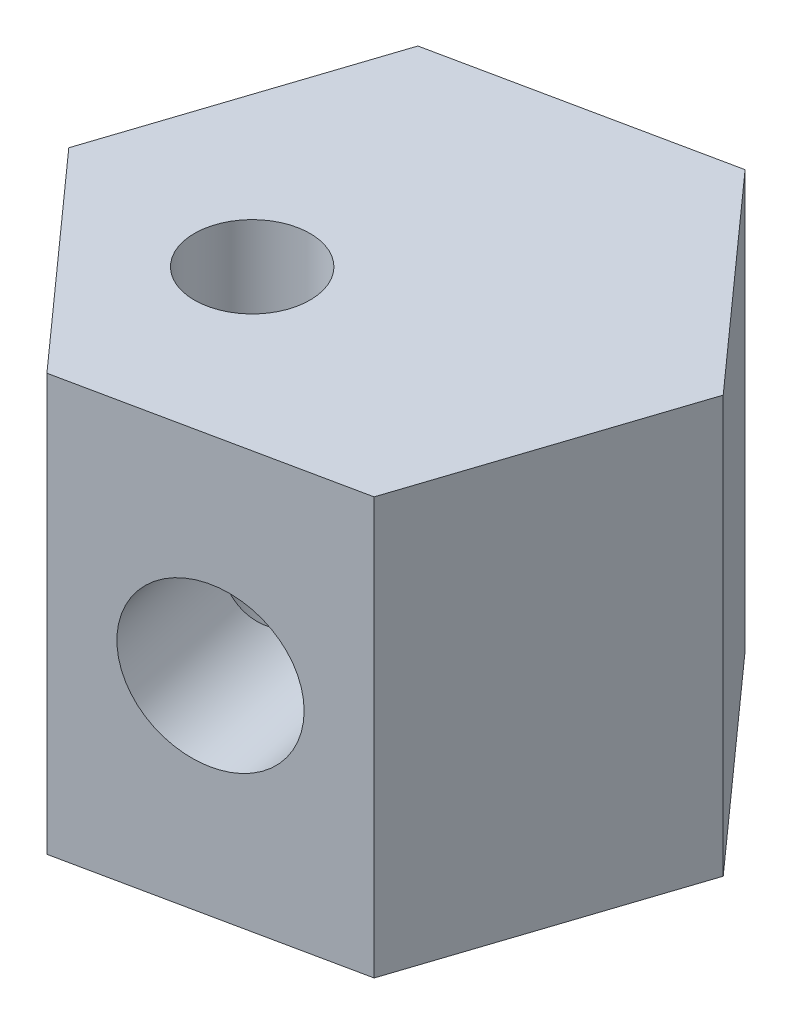
ISO-10303-21;
HEADER;
FILE_DESCRIPTION(('STEP AP214'),'2;1');
FILE_NAME('part.step','',(''),(''),'','','');
FILE_SCHEMA(('AUTOMOTIVE_DESIGN { 1 0 10303 214 1 1 1 1 }'));
ENDSEC;
DATA;
#1=APPLICATION_CONTEXT('core data for automotive mechanical design processes');
#2=APPLICATION_PROTOCOL_DEFINITION('international standard','automotive_design',2000,#1);
#3=PRODUCT_CONTEXT('',#1,'mechanical');
#4=PRODUCT('Part','Part','',(#3));
#5=PRODUCT_RELATED_PRODUCT_CATEGORY('part','',(#4));
#6=PRODUCT_DEFINITION_FORMATION('','',#4);
#7=PRODUCT_DEFINITION_CONTEXT('part definition',#1,'design');
#8=PRODUCT_DEFINITION('design','',#6,#7);
#9=PRODUCT_DEFINITION_SHAPE('','',#8);
#10=(LENGTH_UNIT() NAMED_UNIT(*) SI_UNIT(.MILLI.,.METRE.));
#11=(NAMED_UNIT(*) PLANE_ANGLE_UNIT() SI_UNIT($,.RADIAN.));
#12=(NAMED_UNIT(*) SI_UNIT($,.STERADIAN.) SOLID_ANGLE_UNIT());
#13=UNCERTAINTY_MEASURE_WITH_UNIT(LENGTH_MEASURE(1.E-05),#10,'distance_accuracy_value','');
#14=(GEOMETRIC_REPRESENTATION_CONTEXT(3) GLOBAL_UNCERTAINTY_ASSIGNED_CONTEXT((#13)) GLOBAL_UNIT_ASSIGNED_CONTEXT((#10,
#11,#12)) REPRESENTATION_CONTEXT('',''));
#15=CARTESIAN_POINT('',(0.,0.,0.));
#16=DIRECTION('',(0.,0.,1.));
#17=DIRECTION('',(1.,0.,0.));
#18=AXIS2_PLACEMENT_3D('',#15,#16,#17);
#19=CARTESIAN_POINT('',(18.73,28.83,-3.9100063291939));
#20=DIRECTION('',(-0.74557469293488,0.,0.666422071404496));
#21=DIRECTION('',(0.666422071404496,0.,0.74557469293488));
#22=AXIS2_PLACEMENT_3D('',#19,#20,#21);
#23=PLANE('',#22);
#24=DIRECTION('',(-0.666422071404496,0.,-0.74557469293488));
#25=VECTOR('',#24,1.);
#26=CARTESIAN_POINT('',(18.73,0.,-3.9100063291939));
#27=LINE('',#26,#25);
#28=CARTESIAN_POINT('',(18.73,0.,-3.9100063291939));
#29=VERTEX_POINT('',#28);
#30=CARTESIAN_POINT('',(5.97883518996014,0.,-18.1756589774795));
#31=VERTEX_POINT('',#30);
#32=EDGE_CURVE('E125',#29,#31,#27,.T.);
#33=ORIENTED_EDGE('',*,*,#32,.T.);
#34=DIRECTION('',(0.,-1.,0.));
#35=VECTOR('',#34,1.);
#36=CARTESIAN_POINT('',(5.97883518996014,28.83,-18.1756589774795));
#37=LINE('',#36,#35);
#38=CARTESIAN_POINT('',(5.97883518996014,28.83,-18.1756589774795));
#39=VERTEX_POINT('',#38);
#40=EDGE_CURVE('E11',#39,#31,#37,.T.);
#41=ORIENTED_EDGE('',*,*,#40,.F.);
#42=DIRECTION('',(-0.666422071404496,0.,-0.74557469293488));
#43=VECTOR('',#42,1.);
#44=CARTESIAN_POINT('',(18.73,28.83,-3.9100063291939));
#45=LINE('',#44,#43);
#46=CARTESIAN_POINT('',(18.73,28.83,-3.9100063291939));
#47=VERTEX_POINT('',#46);
#48=EDGE_CURVE('E136',#47,#39,#45,.T.);
#49=ORIENTED_EDGE('',*,*,#48,.F.);
#50=DIRECTION('',(0.,-1.,0.));
#51=VECTOR('',#50,1.);
#52=CARTESIAN_POINT('',(18.73,28.83,-3.9100063291939));
#53=LINE('',#52,#51);
#54=EDGE_CURVE('E121',#47,#29,#53,.T.);
#55=ORIENTED_EDGE('',*,*,#54,.T.);
#56=EDGE_LOOP('',(#33,#41,#49,#55));
#57=FACE_BOUND('',#56,.T.);
#58=ADVANCED_FACE('F35',(#57),#23,.F.);
#59=CARTESIAN_POINT('',(5.97883518996014,28.83,-18.1756589774795));
#60=DIRECTION('',(0.204351097011501,0.,0.978897660202636));
#61=DIRECTION('',(0.978897660202636,0.,-0.204351097011501));
#62=AXIS2_PLACEMENT_3D('',#59,#60,#61);
#63=PLANE('',#62);
#64=CARTESIAN_POINT('',(-3.38616481003986,14.415,-16.2206558128825));
#65=DIRECTION('',(0.204351097011501,0.,0.978897660202636));
#66=DIRECTION('',(0.978897660202636,0.,-0.204351097011501));
#67=AXIS2_PLACEMENT_3D('',#64,#65,#66);
#68=CIRCLE('',#67,5.475);
#69=CARTESIAN_POINT('',(1.97329987956957,14.415,-17.3394780690205));
#70=VERTEX_POINT('',#69);
#71=EDGE_CURVE('E129',#70,#70,#68,.T.);
#72=ORIENTED_EDGE('',*,*,#71,.T.);
#73=EDGE_LOOP('',(#72));
#74=FACE_BOUND('',#73,.T.);
#75=DIRECTION('',(-0.978897660202636,0.,0.204351097011501));
#76=VECTOR('',#75,1.);
#77=CARTESIAN_POINT('',(5.97883518996014,0.,-18.1756589774795));
#78=LINE('',#77,#76);
#79=CARTESIAN_POINT('',(-12.7511648100399,0.,-14.2656526482856));
#80=VERTEX_POINT('',#79);
#81=EDGE_CURVE('E128',#31,#80,#78,.T.);
#82=ORIENTED_EDGE('',*,*,#81,.T.);
#83=DIRECTION('',(0.,-1.,0.));
#84=VECTOR('',#83,1.);
#85=CARTESIAN_POINT('',(-12.7511648100399,28.83,-14.2656526482856));
#86=LINE('',#85,#84);
#87=CARTESIAN_POINT('',(-12.7511648100399,28.83,-14.2656526482856));
#88=VERTEX_POINT('',#87);
#89=EDGE_CURVE('E49',#88,#80,#86,.T.);
#90=ORIENTED_EDGE('',*,*,#89,.F.);
#91=DIRECTION('',(-0.978897660202636,0.,0.204351097011501));
#92=VECTOR('',#91,1.);
#93=CARTESIAN_POINT('',(5.97883518996014,28.83,-18.1756589774795));
#94=LINE('',#93,#92);
#95=EDGE_CURVE('E94',#39,#88,#94,.T.);
#96=ORIENTED_EDGE('',*,*,#95,.F.);
#97=ORIENTED_EDGE('',*,*,#40,.T.);
#98=EDGE_LOOP('',(#82,#90,#96,#97));
#99=FACE_BOUND('',#98,.T.);
#100=ADVANCED_FACE('F163',(#74,#99),#63,.F.);
#101=CARTESIAN_POINT('',(-12.7511648100399,28.83,-14.2656526482856));
#102=DIRECTION('',(0.949925789946381,0.,0.31247558879814));
#103=DIRECTION('',(0.31247558879814,0.,-0.949925789946381));
#104=AXIS2_PLACEMENT_3D('',#101,#102,#103);
#105=PLANE('',#104);
#106=DIRECTION('',(-0.31247558879814,0.,0.949925789946381));
#107=VECTOR('',#106,1.);
#108=CARTESIAN_POINT('',(-12.7511648100399,0.,-14.2656526482856));
#109=LINE('',#108,#107);
#110=CARTESIAN_POINT('',(-18.73,0.,3.91000632919391));
#111=VERTEX_POINT('',#110);
#112=EDGE_CURVE('E131',#80,#111,#109,.T.);
#113=ORIENTED_EDGE('',*,*,#112,.T.);
#114=DIRECTION('',(0.,-1.,0.));
#115=VECTOR('',#114,1.);
#116=CARTESIAN_POINT('',(-18.73,28.83,3.91000632919391));
#117=LINE('',#116,#115);
#118=CARTESIAN_POINT('',(-18.73,28.83,3.91000632919391));
#119=VERTEX_POINT('',#118);
#120=EDGE_CURVE('E116',#119,#111,#117,.T.);
#121=ORIENTED_EDGE('',*,*,#120,.F.);
#122=DIRECTION('',(-0.31247558879814,0.,0.949925789946381));
#123=VECTOR('',#122,1.);
#124=CARTESIAN_POINT('',(-12.7511648100399,28.83,-14.2656526482856));
#125=LINE('',#124,#123);
#126=EDGE_CURVE('E107',#88,#119,#125,.T.);
#127=ORIENTED_EDGE('',*,*,#126,.F.);
#128=ORIENTED_EDGE('',*,*,#89,.T.);
#129=EDGE_LOOP('',(#113,#121,#127,#128));
#130=FACE_BOUND('',#129,.T.);
#131=ADVANCED_FACE('F143',(#130),#105,.F.);
#132=CARTESIAN_POINT('',(-18.73,28.83,3.91000632919391));
#133=DIRECTION('',(0.74557469293488,0.,-0.666422071404496));
#134=DIRECTION('',(-0.666422071404496,0.,-0.74557469293488));
#135=AXIS2_PLACEMENT_3D('',#132,#133,#134);
#136=PLANE('',#135);
#137=DIRECTION('',(0.666422071404496,0.,0.74557469293488));
#138=VECTOR('',#137,1.);
#139=CARTESIAN_POINT('',(-18.73,0.,3.91000632919391));
#140=LINE('',#139,#138);
#141=CARTESIAN_POINT('',(-5.97883518996014,0.,18.1756589774795));
#142=VERTEX_POINT('',#141);
#143=EDGE_CURVE('E115',#111,#142,#140,.T.);
#144=ORIENTED_EDGE('',*,*,#143,.T.);
#145=DIRECTION('',(0.,-1.,0.));
#146=VECTOR('',#145,1.);
#147=CARTESIAN_POINT('',(-5.97883518996014,28.83,18.1756589774795));
#148=LINE('',#147,#146);
#149=CARTESIAN_POINT('',(-5.97883518996014,28.83,18.1756589774795));
#150=VERTEX_POINT('',#149);
#151=EDGE_CURVE('E112',#150,#142,#148,.T.);
#152=ORIENTED_EDGE('',*,*,#151,.F.);
#153=DIRECTION('',(0.666422071404496,0.,0.74557469293488));
#154=VECTOR('',#153,1.);
#155=CARTESIAN_POINT('',(-18.73,28.83,3.91000632919391));
#156=LINE('',#155,#154);
#157=EDGE_CURVE('E101',#119,#150,#156,.T.);
#158=ORIENTED_EDGE('',*,*,#157,.F.);
#159=ORIENTED_EDGE('',*,*,#120,.T.);
#160=EDGE_LOOP('',(#144,#152,#158,#159));
#161=FACE_BOUND('',#160,.T.);
#162=ADVANCED_FACE('F113',(#161),#136,.F.);
#163=CARTESIAN_POINT('',(-5.97883518996014,28.83,18.1756589774795));
#164=DIRECTION('',(-0.204351097011501,0.,-0.978897660202636));
#165=DIRECTION('',(-0.978897660202636,0.,0.204351097011501));
#166=AXIS2_PLACEMENT_3D('',#163,#164,#165);
#167=PLANE('',#166);
#168=CARTESIAN_POINT('',(3.38616481003986,14.415,16.2206558128825));
#169=DIRECTION('',(0.204351097011501,0.,0.978897660202636));
#170=DIRECTION('',(0.978897660202636,0.,-0.204351097011501));
#171=AXIS2_PLACEMENT_3D('',#168,#169,#170);
#172=CIRCLE('',#171,5.475);
#173=CARTESIAN_POINT('',(8.7456294996493,14.415,15.1018335567446));
#174=VERTEX_POINT('',#173);
#175=EDGE_CURVE('E234',#174,#174,#172,.T.);
#176=ORIENTED_EDGE('',*,*,#175,.F.);
#177=EDGE_LOOP('',(#176));
#178=FACE_BOUND('',#177,.T.);
#179=DIRECTION('',(0.978897660202636,0.,-0.204351097011501));
#180=VECTOR('',#179,1.);
#181=CARTESIAN_POINT('',(-5.97883518996014,0.,18.1756589774795));
#182=LINE('',#181,#180);
#183=CARTESIAN_POINT('',(12.7511648100399,0.,14.2656526482856));
#184=VERTEX_POINT('',#183);
#185=EDGE_CURVE('E80',#142,#184,#182,.T.);
#186=ORIENTED_EDGE('',*,*,#185,.T.);
#187=DIRECTION('',(0.,-1.,0.));
#188=VECTOR('',#187,1.);
#189=CARTESIAN_POINT('',(12.7511648100399,28.83,14.2656526482856));
#190=LINE('',#189,#188);
#191=CARTESIAN_POINT('',(12.7511648100399,28.83,14.2656526482856));
#192=VERTEX_POINT('',#191);
#193=EDGE_CURVE('E117',#192,#184,#190,.T.);
#194=ORIENTED_EDGE('',*,*,#193,.F.);
#195=DIRECTION('',(0.978897660202636,0.,-0.204351097011501));
#196=VECTOR('',#195,1.);
#197=CARTESIAN_POINT('',(-5.97883518996014,28.83,18.1756589774795));
#198=LINE('',#197,#196);
#199=EDGE_CURVE('E105',#150,#192,#198,.T.);
#200=ORIENTED_EDGE('',*,*,#199,.F.);
#201=ORIENTED_EDGE('',*,*,#151,.T.);
#202=EDGE_LOOP('',(#186,#194,#200,#201));
#203=FACE_BOUND('',#202,.T.);
#204=ADVANCED_FACE('F119',(#178,#203),#167,.F.);
#205=CARTESIAN_POINT('',(12.7511648100399,28.83,14.2656526482856));
#206=DIRECTION('',(-0.949925789946381,0.,-0.31247558879814));
#207=DIRECTION('',(-0.31247558879814,0.,0.949925789946381));
#208=AXIS2_PLACEMENT_3D('',#205,#206,#207);
#209=PLANE('',#208);
#210=DIRECTION('',(0.31247558879814,0.,-0.949925789946381));
#211=VECTOR('',#210,1.);
#212=CARTESIAN_POINT('',(12.7511648100399,0.,14.2656526482856));
#213=LINE('',#212,#211);
#214=EDGE_CURVE('E86',#184,#29,#213,.T.);
#215=ORIENTED_EDGE('',*,*,#214,.T.);
#216=ORIENTED_EDGE('',*,*,#54,.F.);
#217=DIRECTION('',(0.31247558879814,0.,-0.949925789946381));
#218=VECTOR('',#217,1.);
#219=CARTESIAN_POINT('',(12.7511648100399,28.83,14.2656526482856));
#220=LINE('',#219,#218);
#221=EDGE_CURVE('E57',#192,#47,#220,.T.);
#222=ORIENTED_EDGE('',*,*,#221,.F.);
#223=ORIENTED_EDGE('',*,*,#193,.T.);
#224=EDGE_LOOP('',(#215,#216,#222,#223));
#225=FACE_BOUND('',#224,.T.);
#226=ADVANCED_FACE('F150',(#225),#209,.F.);
#227=CARTESIAN_POINT('',(0.,28.83,0.));
#228=DIRECTION('',(0.,1.,0.));
#229=DIRECTION('',(0.,0.,1.));
#230=AXIS2_PLACEMENT_3D('',#227,#228,#229);
#231=PLANE('',#230);
#232=CARTESIAN_POINT('',(-5.25397962491386,28.83,4.69620014993981));
#233=DIRECTION('',(0.,1.,0.));
#234=DIRECTION('',(0.,0.,1.));
#235=AXIS2_PLACEMENT_3D('',#232,#233,#234);
#236=CIRCLE('',#235,4.);
#237=CARTESIAN_POINT('',(-5.25397962491386,28.83,8.69620014993981));
#238=VERTEX_POINT('',#237);
#239=EDGE_CURVE('E227',#238,#238,#236,.T.);
#240=ORIENTED_EDGE('',*,*,#239,.F.);
#241=EDGE_LOOP('',(#240));
#242=FACE_BOUND('',#241,.T.);
#243=ORIENTED_EDGE('',*,*,#48,.T.);
#244=ORIENTED_EDGE('',*,*,#95,.T.);
#245=ORIENTED_EDGE('',*,*,#126,.T.);
#246=ORIENTED_EDGE('',*,*,#157,.T.);
#247=ORIENTED_EDGE('',*,*,#199,.T.);
#248=ORIENTED_EDGE('',*,*,#221,.T.);
#249=EDGE_LOOP('',(#243,#244,#245,#246,#247,#248));
#250=FACE_BOUND('',#249,.T.);
#251=ADVANCED_FACE('F103',(#242,#250),#231,.T.);
#252=CARTESIAN_POINT('',(0.,0.,0.));
#253=DIRECTION('',(0.,1.,0.));
#254=DIRECTION('',(0.,0.,1.));
#255=AXIS2_PLACEMENT_3D('',#252,#253,#254);
#256=PLANE('',#255);
#257=CARTESIAN_POINT('',(-5.25397962491386,0.,4.69620014993981));
#258=DIRECTION('',(0.,1.,0.));
#259=DIRECTION('',(0.,0.,1.));
#260=AXIS2_PLACEMENT_3D('',#257,#258,#259);
#261=CIRCLE('',#260,4.);
#262=CARTESIAN_POINT('',(-5.25397962491386,0.,8.69620014993981));
#263=VERTEX_POINT('',#262);
#264=EDGE_CURVE('E231',#263,#263,#261,.T.);
#265=ORIENTED_EDGE('',*,*,#264,.T.);
#266=EDGE_LOOP('',(#265));
#267=FACE_BOUND('',#266,.T.);
#268=ORIENTED_EDGE('',*,*,#32,.F.);
#269=ORIENTED_EDGE('',*,*,#214,.F.);
#270=ORIENTED_EDGE('',*,*,#185,.F.);
#271=ORIENTED_EDGE('',*,*,#143,.F.);
#272=ORIENTED_EDGE('',*,*,#112,.F.);
#273=ORIENTED_EDGE('',*,*,#81,.F.);
#274=EDGE_LOOP('',(#268,#269,#270,#271,#272,#273));
#275=FACE_BOUND('',#274,.T.);
#276=ADVANCED_FACE('F146',(#267,#275),#256,.F.);
#277=CARTESIAN_POINT('',(-13.3706251449032,14.415,-64.0489523237337));
#278=DIRECTION('',(0.204351097011501,0.,0.978897660202636));
#279=DIRECTION('',(0.978897660202636,0.,-0.204351097011501));
#280=AXIS2_PLACEMENT_3D('',#277,#278,#279);
#281=CYLINDRICAL_SURFACE('',#280,5.475);
#282=CARTESIAN_POINT('',(-5.44671979196973,14.415,0.700846444946555));
#283=CARTESIAN_POINT('',(-5.44671932996338,14.2442882142653,0.700844570930919));
#284=CARTESIAN_POINT('',(-5.43864239691892,14.0735593124056,0.700431740314194));
#285=CARTESIAN_POINT('',(-5.40634646627643,13.7336068470725,0.699071022490615));
#286=CARTESIAN_POINT('',(-5.38212407291833,13.5643836078633,0.698123022731856));
#287=CARTESIAN_POINT('',(-5.31757364133624,13.2289031656981,0.696575334617757));
#288=CARTESIAN_POINT('',(-5.2772341636406,13.0626481572602,0.69597589440418));
#289=CARTESIAN_POINT('',(-5.18059510562908,12.7348596870066,0.696581470328495));
#290=CARTESIAN_POINT('',(-5.1242988146617,12.5733252596496,0.697786114790132));
#291=CARTESIAN_POINT('',(-5.0036745559567,12.2754682275964,0.703639811205725));
#292=CARTESIAN_POINT('',(-4.94109318323438,12.1384289726995,0.707863032351391));
#293=CARTESIAN_POINT('',(-4.80416623720138,11.8705539079886,0.720977198669178));
#294=CARTESIAN_POINT('',(-4.72982038725676,11.7397182441421,0.729868253613742));
#295=CARTESIAN_POINT('',(-4.57029532314061,11.4859787353574,0.754238042394673));
#296=CARTESIAN_POINT('',(-4.48514801980157,11.3630530720235,0.769697674505164));
#297=CARTESIAN_POINT('',(-4.30499363301192,11.1261710616869,0.80931010052227));
#298=CARTESIAN_POINT('',(-4.20999171352194,11.0122100715691,0.833458357678645));
#299=CARTESIAN_POINT('',(-4.04307828181516,10.8289188527064,0.883231254905319));
#300=CARTESIAN_POINT('',(-3.97331626684821,10.7568350609931,0.905996353583617));
#301=CARTESIAN_POINT('',(-3.83071758032128,10.6179304070752,0.957208277305111));
#302=CARTESIAN_POINT('',(-3.7578817010418,10.5511082012825,0.985653645242621));
#303=CARTESIAN_POINT('',(-3.61003690799761,10.4230968025676,1.04874796089784));
#304=CARTESIAN_POINT('',(-3.53502900159616,10.361905051616,1.08339407021234));
#305=CARTESIAN_POINT('',(-3.38381240375823,10.2453716814535,1.15930462052926));
#306=CARTESIAN_POINT('',(-3.30760366921122,10.1900302728261,1.20056929963319));
#307=CARTESIAN_POINT('',(-3.15481915386376,10.0851507170114,1.29011852385531));
#308=CARTESIAN_POINT('',(-3.07824303073846,10.0356338784055,1.33842747984167));
#309=CARTESIAN_POINT('',(-2.9261506190157,9.94263189828677,1.44202175502169));
#310=CARTESIAN_POINT('',(-2.85063433672275,9.89914679264033,1.49730711569525));
#311=CARTESIAN_POINT('',(-2.70178848284588,9.81806287914998,1.61475412575604));
#312=CARTESIAN_POINT('',(-2.6284594260988,9.7804654484533,1.67691737812027));
#313=CARTESIAN_POINT('',(-2.48508643628124,9.71091458047684,1.80783497985879));
#314=CARTESIAN_POINT('',(-2.41504240923113,9.67896098166332,1.8765891405059));
#315=CARTESIAN_POINT('',(-2.28317733634347,9.62206466760694,2.01608754929861));
#316=CARTESIAN_POINT('',(-2.22111496241671,9.596821811162,2.08648204651825));
#317=CARTESIAN_POINT('',(-2.10145807676479,9.55070142010797,2.2323595983266));
#318=CARTESIAN_POINT('',(-2.04386512794508,9.52982540824499,2.3078444158488));
#319=CARTESIAN_POINT('',(-1.93380027607785,9.49211948966779,2.4633804608781));
#320=CARTESIAN_POINT('',(-1.88132691137695,9.47528842609138,2.54343037463655));
#321=CARTESIAN_POINT('',(-1.78197545685594,9.4453386176669,2.70763292191346));
#322=CARTESIAN_POINT('',(-1.73509949411334,9.4322212814986,2.79178709809747));
#323=CARTESIAN_POINT('',(-1.64612150139419,9.40909510498959,2.96611054316569));
#324=CARTESIAN_POINT('',(-1.60419600617925,9.3991867545163,3.05638327156967));
#325=CARTESIAN_POINT('',(-1.52709138107495,9.38275662986966,3.24009838699157));
#326=CARTESIAN_POINT('',(-1.4919146032147,9.37623603503246,3.33354186575909));
#327=CARTESIAN_POINT('',(-1.42860903495376,9.36641148793812,3.52295211897212));
#328=CARTESIAN_POINT('',(-1.40048033592288,9.36310757737979,3.61891892611171));
#329=CARTESIAN_POINT('',(-1.35148067752791,9.35962442129355,3.81274392134406));
#330=CARTESIAN_POINT('',(-1.33060983922478,9.35944522788339,3.91060214095681));
#331=CARTESIAN_POINT('',(-1.29568551331156,9.36225296188397,4.11089133208306));
#332=CARTESIAN_POINT('',(-1.28188582893936,9.3653469285274,4.21336518106398));
#333=CARTESIAN_POINT('',(-1.26227005941801,9.37495904508249,4.4188798577269));
#334=CARTESIAN_POINT('',(-1.2564512945909,9.38147604465782,4.5219204834351));
#335=CARTESIAN_POINT('',(-1.2527786363434,9.39812475526774,4.72789901075321));
#336=CARTESIAN_POINT('',(-1.25492823514739,9.40825804942522,4.83083684754182));
#337=CARTESIAN_POINT('',(-1.26709655146743,9.43240700774915,5.03574775356472));
#338=CARTESIAN_POINT('',(-1.27711207618279,9.4464210951972,5.13772119725629));
#339=CARTESIAN_POINT('',(-1.30476440780095,9.4786315350618,5.33967314405095));
#340=CARTESIAN_POINT('',(-1.32238041685228,9.49681641143946,5.43965631780093));
#341=CARTESIAN_POINT('',(-1.36489688904194,9.53776664855319,5.6370640034054));
#342=CARTESIAN_POINT('',(-1.38979442235018,9.56053016585663,5.73448952722002));
#343=CARTESIAN_POINT('',(-1.4464088758348,9.61103697451772,5.92598498207631));
#344=CARTESIAN_POINT('',(-1.47812399093157,9.63877894741756,6.02005579366774));
#345=CARTESIAN_POINT('',(-1.54776827768813,9.69962865224916,6.20407077985783));
#346=CARTESIAN_POINT('',(-1.58569717893218,9.73273615067968,6.29401513381653));
#347=CARTESIAN_POINT('',(-1.66543470827131,9.80325101722377,6.46564969504358));
#348=CARTESIAN_POINT('',(-1.70703681077209,9.84044282413473,6.54752454794656));
#349=CARTESIAN_POINT('',(-1.79449311913277,9.92030591713717,6.7062159578722));
#350=CARTESIAN_POINT('',(-1.84034874402862,9.96297903371205,6.78303081208503));
#351=CARTESIAN_POINT('',(-1.93537011765979,10.0538714148355,6.9310519561655));
#352=CARTESIAN_POINT('',(-1.98453398520202,10.102087538287,7.00226138433087));
#353=CARTESIAN_POINT('',(-2.08524689738435,10.20409025889,7.13880813066526));
#354=CARTESIAN_POINT('',(-2.13679682392201,10.2578789249203,7.20414325098488));
#355=CARTESIAN_POINT('',(-2.24040702938888,10.3699434576381,7.32769670873086));
#356=CARTESIAN_POINT('',(-2.29244470037684,10.4281302097085,7.38601502716644));
#357=CARTESIAN_POINT('',(-2.39694748300127,10.549549847166,7.4967657054883));
#358=CARTESIAN_POINT('',(-2.44941274001426,10.612784519073,7.54919596557791));
#359=CARTESIAN_POINT('',(-2.55388158868853,10.7439824206625,7.64825938193302));
#360=CARTESIAN_POINT('',(-2.60588519805761,10.8119454680834,7.69489276145428));
#361=CARTESIAN_POINT('',(-2.70866272625008,10.9522775508807,7.78261056194154));
#362=CARTESIAN_POINT('',(-2.75943618690802,11.0246481936359,7.82369294075451));
#363=CARTESIAN_POINT('',(-2.86385062979914,11.1805831912231,7.90432195973052));
#364=CARTESIAN_POINT('',(-2.91729513316019,11.2645536537172,7.94333731358445));
#365=CARTESIAN_POINT('',(-3.02108395026209,11.4368361818822,8.01556411751072));
#366=CARTESIAN_POINT('',(-3.07142695303678,11.5251500554793,8.04877312406531));
#367=CARTESIAN_POINT('',(-3.16835531271104,11.7056089757783,8.10991605770719));
#368=CARTESIAN_POINT('',(-3.21493967694612,11.7977550248918,8.1378485938628));
#369=CARTESIAN_POINT('',(-3.30381106355815,11.9853779381211,8.18897421046636));
#370=CARTESIAN_POINT('',(-3.34609756033706,12.0808552077076,8.21216671159212));
#371=CARTESIAN_POINT('',(-3.43358195016986,12.2932256778534,8.25836937151913));
#372=CARTESIAN_POINT('',(-3.47778869639922,12.410721013372,8.28049549762994));
#373=CARTESIAN_POINT('',(-3.55891856003127,12.6490410266193,8.31956805734644));
#374=CARTESIAN_POINT('',(-3.59584093474202,12.7698660424019,8.33651396288959));
#375=CARTESIAN_POINT('',(-3.66198574715897,13.0141968191784,8.36592315712578));
#376=CARTESIAN_POINT('',(-3.69120475881113,13.1377037466054,8.37838445219438));
#377=CARTESIAN_POINT('',(-3.74160629678534,13.3866769525502,8.39937051650646));
#378=CARTESIAN_POINT('',(-3.76278835565762,13.5121433445938,8.40789505678443));
#379=CARTESIAN_POINT('',(-3.79942305404076,13.7830831500888,8.42242019628559));
#380=CARTESIAN_POINT('',(-3.81356160550875,13.9287662969209,8.42785962125721));
#381=CARTESIAN_POINT('',(-3.83076337068699,14.2208896087735,8.43445357951064));
#382=CARTESIAN_POINT('',(-3.83382551273386,14.3673298456714,8.43560769818133));
#383=CARTESIAN_POINT('',(-3.82883161644677,14.6600900042361,8.43370746299262));
#384=CARTESIAN_POINT('',(-3.82076839056511,14.8064097869582,8.43065038849253));
#385=CARTESIAN_POINT('',(-3.79361624194174,15.0978607057266,8.42011608193978));
#386=CARTESIAN_POINT('',(-3.77452743686649,15.2429918544413,8.41263889705913));
#387=CARTESIAN_POINT('',(-3.7246642335986,15.5364641831381,8.39240727096535));
#388=CARTESIAN_POINT('',(-3.69348076876528,15.684723361698,8.37946650504471));
#389=CARTESIAN_POINT('',(-3.61998533331103,15.9778071790356,8.34745583302558));
#390=CARTESIAN_POINT('',(-3.57767211513675,16.1226314308013,8.32838523977088));
#391=CARTESIAN_POINT('',(-3.48264775241517,16.4075327305648,8.28300271025911));
#392=CARTESIAN_POINT('',(-3.42994539172692,16.5476136725198,8.25669688390403));
#393=CARTESIAN_POINT('',(-3.31508351612392,16.8218810867731,8.19547361388514));
#394=CARTESIAN_POINT('',(-3.25292687314831,16.9560693332042,8.16055878339564));
#395=CARTESIAN_POINT('',(-3.13615699391091,17.1863090107953,8.09006323512389));
#396=CARTESIAN_POINT('',(-3.08323791934201,17.2838724742006,8.05659413528853));
#397=CARTESIAN_POINT('',(-2.97342784365001,17.4741492621256,7.98306020653589));
#398=CARTESIAN_POINT('',(-2.91653774746424,17.5668636833007,7.94299687753848));
#399=CARTESIAN_POINT('',(-2.79975852098684,17.7467359299571,7.85564771054856));
#400=CARTESIAN_POINT('',(-2.73987180258601,17.8338980998055,7.80836762020286));
#401=CARTESIAN_POINT('',(-2.61818279619119,18.002108597977,7.70599985428967));
#402=CARTESIAN_POINT('',(-2.55638048121349,18.083156840122,7.65091206870138));
#403=CARTESIAN_POINT('',(-2.43164412214192,18.2392152203331,7.53202551003411));
#404=CARTESIAN_POINT('',(-2.36870491777239,18.3141676157805,7.46815608423947));
#405=CARTESIAN_POINT('',(-2.24373112226607,18.456755645169,7.33190601028322));
#406=CARTESIAN_POINT('',(-2.18169653517115,18.5243912464271,7.25952532410605));
#407=CARTESIAN_POINT('',(-2.06017492942492,18.6519841252092,7.10641937313032));
#408=CARTESIAN_POINT('',(-2.00068665368831,18.7119452213415,7.0256982946856));
#409=CARTESIAN_POINT('',(-1.885843553951,18.8241074509863,6.85632085798259));
#410=CARTESIAN_POINT('',(-1.83048816129857,18.8763096530437,6.76766559510915));
#411=CARTESIAN_POINT('',(-1.73269427540299,18.966375606379,6.59591697103795));
#412=CARTESIAN_POINT('',(-1.68952819177168,19.0052238979148,6.51375041726944));
#413=CARTESIAN_POINT('',(-1.60824322123762,19.0774508292322,6.34465498335903));
#414=CARTESIAN_POINT('',(-1.57012415204029,19.1108296665768,6.2577262753832));
#415=CARTESIAN_POINT('',(-1.4996675582681,19.1724060113571,6.07978245277156));
#416=CARTESIAN_POINT('',(-1.46733046858728,19.200603129052,5.9887670313955));
#417=CARTESIAN_POINT('',(-1.40903708444644,19.2521617702952,5.80338495843747));
#418=CARTESIAN_POINT('',(-1.38308090441171,19.2755232071267,5.7090182467934));
#419=CARTESIAN_POINT('',(-1.33866682569947,19.3171662227288,5.52047711028422));
#420=CARTESIAN_POINT('',(-1.32001269969112,19.3355758472038,5.42637700700717));
#421=CARTESIAN_POINT('',(-1.28945484537029,19.3685267298089,5.23638890595803));
#422=CARTESIAN_POINT('',(-1.27755334028704,19.3830667130649,5.1405003300701));
#423=CARTESIAN_POINT('',(-1.26071935288034,19.4085707460695,4.94767018325217));
#424=CARTESIAN_POINT('',(-1.25578502059409,19.4195357444732,4.85072889873497));
#425=CARTESIAN_POINT('',(-1.25299686444273,19.4381527926677,4.65639493128542));
#426=CARTESIAN_POINT('',(-1.2551455609971,19.4458036620656,4.55900209998797));
#427=CARTESIAN_POINT('',(-1.26680484073899,19.4582281214339,4.36045151787827));
#428=CARTESIAN_POINT('',(-1.27661340245938,19.4628710022263,4.25930297781179));
#429=CARTESIAN_POINT('',(-1.30392129307651,19.4689009331996,4.0579508501643));
#430=CARTESIAN_POINT('',(-1.32142079498554,19.4702879101326,3.95774728389284));
#431=CARTESIAN_POINT('',(-1.36400931331053,19.4698462121146,3.75893292266338));
#432=CARTESIAN_POINT('',(-1.38910121914768,19.4680163116476,3.66032274917543));
#433=CARTESIAN_POINT('',(-1.44667768365401,19.4610863712483,3.46543935199479));
#434=CARTESIAN_POINT('',(-1.47915969076867,19.4559874588943,3.36916533437246));
#435=CARTESIAN_POINT('',(-1.55200268141593,19.4422359510588,3.17762206727044));
#436=CARTESIAN_POINT('',(-1.59251204857933,19.4335123846427,3.08241426509842));
#437=CARTESIAN_POINT('',(-1.68057816511022,19.4122702524846,2.89579945056655));
#438=CARTESIAN_POINT('',(-1.72813217137449,19.3997531619229,2.80439097645359));
#439=CARTESIAN_POINT('',(-1.82984156090758,19.3705980572443,2.6259768513341));
#440=CARTESIAN_POINT('',(-1.88399861344264,19.3539589999826,2.53897232155505));
#441=CARTESIAN_POINT('',(-1.99829425466953,19.3161912010148,2.37006484323166));
#442=CARTESIAN_POINT('',(-2.05843025915997,19.295064394539,2.28815971532071));
#443=CARTESIAN_POINT('',(-2.18280015883815,19.2483568343668,2.1315035708415));
#444=CARTESIAN_POINT('',(-2.2469348862982,19.2228680018475,2.05664644848025));
#445=CARTESIAN_POINT('',(-2.37946975241153,19.166804819539,1.91290263097331));
#446=CARTESIAN_POINT('',(-2.44786812662239,19.1362325648234,1.84401349390895));
#447=CARTESIAN_POINT('',(-2.58801654220035,19.0696665259347,1.71260067377483));
#448=CARTESIAN_POINT('',(-2.65976557109285,19.0336743722846,1.65007508574302));
#449=CARTESIAN_POINT('',(-2.80561571141413,18.9559996819589,1.53165637385044));
#450=CARTESIAN_POINT('',(-2.87971673948643,18.9143173467749,1.47576301527083));
#451=CARTESIAN_POINT('',(-3.02610410336976,18.8269460860473,1.37291234831671));
#452=CARTESIAN_POINT('',(-3.0983394926432,18.7814928635526,1.32568182116291));
#453=CARTESIAN_POINT('',(-3.24302058290909,18.685168671173,1.23741021777985));
#454=CARTESIAN_POINT('',(-3.31546634589331,18.6342959032791,1.19637120665033));
#455=CARTESIAN_POINT('',(-3.45956597478618,18.5272434219926,1.12034845167315));
#456=CARTESIAN_POINT('',(-3.53122005893545,18.471065214084,1.085362997987));
#457=CARTESIAN_POINT('',(-3.67289136033968,18.3535546234371,1.02112009702361));
#458=CARTESIAN_POINT('',(-3.74290794017603,18.2922202749278,0.99186484866309));
#459=CARTESIAN_POINT('',(-3.88196467386401,18.1633057784561,0.938108632481321));
#460=CARTESIAN_POINT('',(-3.95095124609768,18.0956194959129,0.913723741401017));
#461=CARTESIAN_POINT('',(-4.08564873413595,17.9555132135851,0.869972111299989));
#462=CARTESIAN_POINT('',(-4.15135846121058,17.8830915176553,0.850607182811706));
#463=CARTESIAN_POINT('',(-4.34263767085246,17.6593065935286,0.799163510730182));
#464=CARTESIAN_POINT('',(-4.46241407852737,17.5013711383573,0.773715192456168));
#465=CARTESIAN_POINT('',(-4.69911603399296,17.1474026470388,0.732785362874117));
#466=CARTESIAN_POINT('',(-4.81306601285195,16.9491752320372,0.719304307769664));
#467=CARTESIAN_POINT('',(-5.01368083626125,16.5388566885091,0.702151899668719));
#468=CARTESIAN_POINT('',(-5.10032586334599,16.3267556249287,0.698487657144111));
#469=CARTESIAN_POINT('',(-5.21824384110916,15.9737683628796,0.696106250499314));
#470=CARTESIAN_POINT('',(-5.25813081998172,15.8356851650512,0.696057297842188));
#471=CARTESIAN_POINT('',(-5.3265872098404,15.5567030782069,0.696711254648087));
#472=CARTESIAN_POINT('',(-5.35515504599503,15.4158038002526,0.697414268681879));
#473=CARTESIAN_POINT('',(-5.40090877040044,15.1320504469608,0.698834197776984));
#474=CARTESIAN_POINT('',(-5.41808468391477,14.9891947699991,0.699551124456423));
#475=CARTESIAN_POINT('',(-5.44099077913764,14.702563484327,0.700558051810203));
#476=CARTESIAN_POINT('',(-5.44672018111031,14.5587878136161,0.700848023400028));
#477=CARTESIAN_POINT('',(-5.44671979196973,14.415,0.700846444946555));
#478=B_SPLINE_CURVE_WITH_KNOTS('',3,(#282,#283,#284,#285,#286,#287,#288,#289,#290,#291,#292,
#293,#294,#295,#296,#297,#298,#299,#300,#301,#302,#303,#304,#305,#306,#307,#308,#309,#310,#311,
#312,#313,#314,#315,#316,#317,#318,#319,#320,#321,#322,#323,#324,#325,#326,#327,#328,#329,#330,
#331,#332,#333,#334,#335,#336,#337,#338,#339,#340,#341,#342,#343,#344,#345,#346,#347,#348,#349,
#350,#351,#352,#353,#354,#355,#356,#357,#358,#359,#360,#361,#362,#363,#364,#365,#366,#367,#368,
#369,#370,#371,#372,#373,#374,#375,#376,#377,#378,#379,#380,#381,#382,#383,#384,#385,#386,#387,
#388,#389,#390,#391,#392,#393,#394,#395,#396,#397,#398,#399,#400,#401,#402,#403,#404,#405,#406,
#407,#408,#409,#410,#411,#412,#413,#414,#415,#416,#417,#418,#419,#420,#421,#422,#423,#424,#425,
#426,#427,#428,#429,#430,#431,#432,#433,#434,#435,#436,#437,#438,#439,#440,#441,#442,#443,#444,
#445,#446,#447,#448,#449,#450,#451,#452,#453,#454,#455,#456,#457,#458,#459,#460,#461,#462,#463,
#464,#465,#466,#467,#468,#469,#470,#471,#472,#473,#474,#475,#476,#477),.UNSPECIFIED.,.T.,.F.,(4,
2,2,2,2,2,2,2,2,2,2,2,2,2,2,2,2,2,2,2,2,2,2,2,2,2,2,2,2,2,2,2,2,2,2,2,2,2,2,2,2,2,2,2,2,2,2,2,2,
2,2,2,2,2,2,2,2,2,2,2,2,2,2,2,2,2,2,2,2,2,2,2,2,2,2,2,2,2,2,2,2,2,2,2,2,2,2,2,2,2,2,2,2,2,2,2,2,
4),(0.,0.51197359746569,1.02405490869596,1.53650032895484,2.04884019009138,2.50036440710893,
2.95189924300008,3.40212988625265,3.8521257827189,4.16041692778698,4.46862909120184,
4.77670052898597,5.0847830520557,5.39395974356543,5.70313827344588,6.01238901356638,
6.32163090109768,6.61284271972659,6.90415591708441,7.19538569894967,7.48672580165471,
7.78646291850266,8.08630430921228,8.38614958680156,8.68599986556369,8.9959680668136,
9.30583216746998,9.61583208558224,9.9257062388774,10.2347377821459,10.5436451526261,
10.8524708347412,11.1612830807399,11.4581635824796,11.7551434864851,12.0519559206114,
12.3488789478102,12.6408822814106,12.9329894206253,13.2250853064046,13.5172883602056,
13.8377050017309,14.1582561631214,14.4788917075219,14.7995664162631,15.1816005373867,
15.5636735894173,15.9459162820456,16.3281812034821,16.767090191851,17.2060416443517,
17.6452768144076,18.0845072969729,18.5401104652278,18.9957647246115,19.4510353750542,
19.9061680025476,20.2536281098109,20.6010092929254,20.9481152409891,21.2952260807234,
21.6453136925603,21.9954028681236,22.3453171667468,22.6951832308882,22.9966569329587,
23.2981197430402,23.5996052182452,23.9010960994264,24.1938132285849,24.4866266759297,
24.7793623591759,25.072202220503,25.3770384559106,25.6818815491426,25.986840801934,
26.2916949218663,26.6028225485493,26.913829342538,27.2249149234625,27.5358666278117,
27.8409298104308,28.1458675750127,28.4507137846909,28.7555492024475,29.0478303884981,
29.340208846639,29.6325045866567,29.9249122738239,30.2236230861584,30.5224414840597,
31.1198405174197,31.8045575127891,32.489770325541,32.9205315063034,33.3513525978101,
33.7825504188358,34.213777612037),.UNSPECIFIED.);
#479=CARTESIAN_POINT('',(-5.44671979196973,14.415,0.700846444946555));
#480=VERTEX_POINT('',#479);
#481=EDGE_CURVE('E38',#480,#480,#478,.T.);
#482=ORIENTED_EDGE('',*,*,#481,.T.);
#483=EDGE_LOOP('',(#482));
#484=FACE_BOUND('',#483,.T.);
#485=ORIENTED_EDGE('',*,*,#175,.T.);
#486=EDGE_LOOP('',(#485));
#487=FACE_BOUND('',#486,.T.);
#488=ORIENTED_EDGE('',*,*,#71,.F.);
#489=EDGE_LOOP('',(#488));
#490=FACE_BOUND('',#489,.T.);
#491=ADVANCED_FACE('F201',(#484,#487,#490),#281,.F.);
#492=CARTESIAN_POINT('',(-5.25397962491386,0.,4.69620014993981));
#493=DIRECTION('',(0.,1.,0.));
#494=DIRECTION('',(0.,0.,1.));
#495=AXIS2_PLACEMENT_3D('',#492,#493,#494);
#496=CYLINDRICAL_SURFACE('',#495,4.);
#497=ORIENTED_EDGE('',*,*,#239,.T.);
#498=EDGE_LOOP('',(#497));
#499=FACE_BOUND('',#498,.T.);
#500=ORIENTED_EDGE('',*,*,#264,.F.);
#501=EDGE_LOOP('',(#500));
#502=FACE_BOUND('',#501,.T.);
#503=ORIENTED_EDGE('',*,*,#481,.F.);
#504=EDGE_LOOP('',(#503));
#505=FACE_BOUND('',#504,.T.);
#506=ADVANCED_FACE('F210',(#499,#502,#505),#496,.F.);
#507=CLOSED_SHELL('',(#58,#100,#131,#162,#204,#226,#251,#276,#491,#506));
#508=MANIFOLD_SOLID_BREP('B2',#507);
#509=ADVANCED_BREP_SHAPE_REPRESENTATION('',(#18,#508),#14);
#510=SHAPE_DEFINITION_REPRESENTATION(#9,#509);
ENDSEC;
END-ISO-10303-21;
